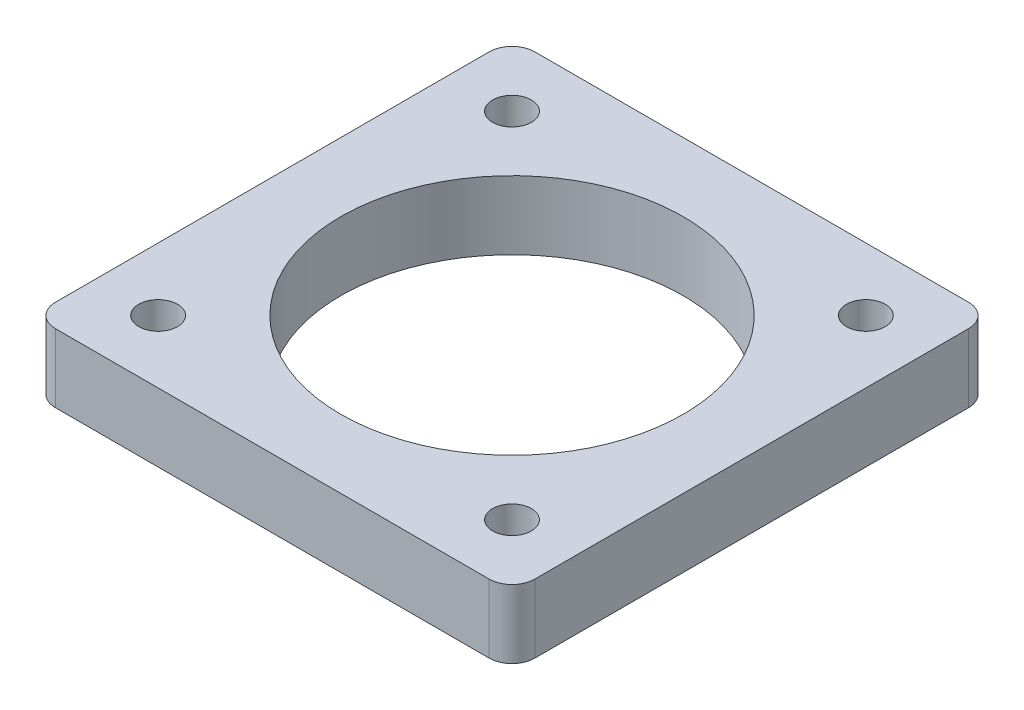
ISO-10303-21;
HEADER;
FILE_DESCRIPTION(('STEP AP214'),'2;1');
FILE_NAME('part.step','',(''),(''),'','','');
FILE_SCHEMA(('AUTOMOTIVE_DESIGN { 1 0 10303 214 1 1 1 1 }'));
ENDSEC;
DATA;
#1=APPLICATION_CONTEXT('core data for automotive mechanical design processes');
#2=APPLICATION_PROTOCOL_DEFINITION('international standard','automotive_design',2000,#1);
#3=PRODUCT_CONTEXT('',#1,'mechanical');
#4=PRODUCT('Part','Part','',(#3));
#5=PRODUCT_RELATED_PRODUCT_CATEGORY('part','',(#4));
#6=PRODUCT_DEFINITION_FORMATION('','',#4);
#7=PRODUCT_DEFINITION_CONTEXT('part definition',#1,'design');
#8=PRODUCT_DEFINITION('design','',#6,#7);
#9=PRODUCT_DEFINITION_SHAPE('','',#8);
#10=(LENGTH_UNIT() NAMED_UNIT(*) SI_UNIT(.MILLI.,.METRE.));
#11=(NAMED_UNIT(*) PLANE_ANGLE_UNIT() SI_UNIT($,.RADIAN.));
#12=(NAMED_UNIT(*) SI_UNIT($,.STERADIAN.) SOLID_ANGLE_UNIT());
#13=UNCERTAINTY_MEASURE_WITH_UNIT(LENGTH_MEASURE(1.E-05),#10,'distance_accuracy_value','');
#14=(GEOMETRIC_REPRESENTATION_CONTEXT(3) GLOBAL_UNCERTAINTY_ASSIGNED_CONTEXT((#13)) GLOBAL_UNIT_ASSIGNED_CONTEXT((#10,
#11,#12)) REPRESENTATION_CONTEXT('',''));
#15=CARTESIAN_POINT('',(0.,0.,0.));
#16=DIRECTION('',(0.,0.,1.));
#17=DIRECTION('',(1.,0.,0.));
#18=AXIS2_PLACEMENT_3D('',#15,#16,#17);
#19=CARTESIAN_POINT('',(0.,6.,0.));
#20=DIRECTION('',(0.,-1.,0.));
#21=DIRECTION('',(0.,0.,-1.));
#22=AXIS2_PLACEMENT_3D('',#19,#20,#21);
#23=PLANE('',#22);
#24=CARTESIAN_POINT('',(5.5,6.,-36.5));
#25=DIRECTION('',(0.,1.,0.));
#26=DIRECTION('',(0.,0.,1.));
#27=AXIS2_PLACEMENT_3D('',#24,#25,#26);
#28=CIRCLE('',#27,1.69999999999999);
#29=CARTESIAN_POINT('',(5.5,6.,-34.8));
#30=VERTEX_POINT('',#29);
#31=EDGE_CURVE('E204',#30,#30,#28,.T.);
#32=ORIENTED_EDGE('',*,*,#31,.F.);
#33=EDGE_LOOP('',(#32));
#34=FACE_BOUND('',#33,.T.);
#35=CARTESIAN_POINT('',(36.5,6.,-5.50000000000001));
#36=DIRECTION('',(0.,1.,0.));
#37=DIRECTION('',(0.,0.,1.));
#38=AXIS2_PLACEMENT_3D('',#35,#36,#37);
#39=CIRCLE('',#38,1.69999999999999);
#40=CARTESIAN_POINT('',(36.5,6.,-3.80000000000002));
#41=VERTEX_POINT('',#40);
#42=EDGE_CURVE('E198',#41,#41,#39,.T.);
#43=ORIENTED_EDGE('',*,*,#42,.F.);
#44=EDGE_LOOP('',(#43));
#45=FACE_BOUND('',#44,.T.);
#46=CARTESIAN_POINT('',(5.50000000000001,6.,-5.50000000000001));
#47=DIRECTION('',(0.,1.,0.));
#48=DIRECTION('',(0.,0.,1.));
#49=AXIS2_PLACEMENT_3D('',#46,#47,#48);
#50=CIRCLE('',#49,1.69999999999999);
#51=CARTESIAN_POINT('',(5.50000000000001,6.,-3.80000000000002));
#52=VERTEX_POINT('',#51);
#53=EDGE_CURVE('E192',#52,#52,#50,.T.);
#54=ORIENTED_EDGE('',*,*,#53,.F.);
#55=EDGE_LOOP('',(#54));
#56=FACE_BOUND('',#55,.T.);
#57=DIRECTION('',(0.,0.,-1.));
#58=VECTOR('',#57,1.);
#59=CARTESIAN_POINT('',(42.,6.,0.));
#60=LINE('',#59,#58);
#61=CARTESIAN_POINT('',(42.,6.,-2.));
#62=VERTEX_POINT('',#61);
#63=CARTESIAN_POINT('',(42.,6.,-40.));
#64=VERTEX_POINT('',#63);
#65=EDGE_CURVE('E174',#62,#64,#60,.T.);
#66=ORIENTED_EDGE('',*,*,#65,.T.);
#67=CARTESIAN_POINT('',(40.,6.,-40.));
#68=DIRECTION('',(0.,-1.,0.));
#69=DIRECTION('',(0.,0.,-1.));
#70=AXIS2_PLACEMENT_3D('',#67,#68,#69);
#71=CIRCLE('',#70,2.);
#72=CARTESIAN_POINT('',(40.,6.,-42.));
#73=VERTEX_POINT('',#72);
#74=EDGE_CURVE('E157',#64,#73,#71,.F.);
#75=ORIENTED_EDGE('',*,*,#74,.T.);
#76=DIRECTION('',(-1.,0.,0.));
#77=VECTOR('',#76,1.);
#78=CARTESIAN_POINT('',(0.,6.,-42.));
#79=LINE('',#78,#77);
#80=CARTESIAN_POINT('',(2.,6.,-42.));
#81=VERTEX_POINT('',#80);
#82=EDGE_CURVE('E128',#73,#81,#79,.T.);
#83=ORIENTED_EDGE('',*,*,#82,.T.);
#84=CARTESIAN_POINT('',(2.,6.,-40.));
#85=DIRECTION('',(0.,-1.,0.));
#86=DIRECTION('',(0.,0.,-1.));
#87=AXIS2_PLACEMENT_3D('',#84,#85,#86);
#88=CIRCLE('',#87,2.);
#89=CARTESIAN_POINT('',(0.,6.,-40.));
#90=VERTEX_POINT('',#89);
#91=EDGE_CURVE('E155',#81,#90,#88,.F.);
#92=ORIENTED_EDGE('',*,*,#91,.T.);
#93=DIRECTION('',(0.,0.,1.));
#94=VECTOR('',#93,1.);
#95=CARTESIAN_POINT('',(0.,6.,0.));
#96=LINE('',#95,#94);
#97=CARTESIAN_POINT('',(0.,6.,-2.));
#98=VERTEX_POINT('',#97);
#99=EDGE_CURVE('E135',#90,#98,#96,.T.);
#100=ORIENTED_EDGE('',*,*,#99,.T.);
#101=CARTESIAN_POINT('',(2.,6.,-2.));
#102=DIRECTION('',(0.,-1.,0.));
#103=DIRECTION('',(0.,0.,-1.));
#104=AXIS2_PLACEMENT_3D('',#101,#102,#103);
#105=CIRCLE('',#104,2.);
#106=CARTESIAN_POINT('',(2.,6.,0.));
#107=VERTEX_POINT('',#106);
#108=EDGE_CURVE('E63',#98,#107,#105,.F.);
#109=ORIENTED_EDGE('',*,*,#108,.T.);
#110=DIRECTION('',(1.,0.,0.));
#111=VECTOR('',#110,1.);
#112=CARTESIAN_POINT('',(0.,6.,0.));
#113=LINE('',#112,#111);
#114=CARTESIAN_POINT('',(40.,6.,0.));
#115=VERTEX_POINT('',#114);
#116=EDGE_CURVE('E138',#107,#115,#113,.T.);
#117=ORIENTED_EDGE('',*,*,#116,.T.);
#118=CARTESIAN_POINT('',(40.,6.,-2.));
#119=DIRECTION('',(0.,-1.,0.));
#120=DIRECTION('',(0.,0.,-1.));
#121=AXIS2_PLACEMENT_3D('',#118,#119,#120);
#122=CIRCLE('',#121,2.);
#123=EDGE_CURVE('E153',#115,#62,#122,.F.);
#124=ORIENTED_EDGE('',*,*,#123,.T.);
#125=EDGE_LOOP('',(#66,#75,#83,#92,#100,#109,#117,#124));
#126=FACE_BOUND('',#125,.T.);
#127=CARTESIAN_POINT('',(21.,6.,-21.));
#128=DIRECTION('',(0.,1.,0.));
#129=DIRECTION('',(0.,0.,1.));
#130=AXIS2_PLACEMENT_3D('',#127,#128,#129);
#131=CIRCLE('',#130,15.);
#132=CARTESIAN_POINT('',(21.,6.,-6.));
#133=VERTEX_POINT('',#132);
#134=EDGE_CURVE('E170',#133,#133,#131,.T.);
#135=ORIENTED_EDGE('',*,*,#134,.F.);
#136=EDGE_LOOP('',(#135));
#137=FACE_BOUND('',#136,.T.);
#138=CARTESIAN_POINT('',(36.5,6.,-36.5));
#139=DIRECTION('',(0.,1.,0.));
#140=DIRECTION('',(0.,0.,1.));
#141=AXIS2_PLACEMENT_3D('',#138,#139,#140);
#142=CIRCLE('',#141,1.69999999999999);
#143=CARTESIAN_POINT('',(36.5,6.,-34.8));
#144=VERTEX_POINT('',#143);
#145=EDGE_CURVE('E186',#144,#144,#142,.T.);
#146=ORIENTED_EDGE('',*,*,#145,.F.);
#147=EDGE_LOOP('',(#146));
#148=FACE_BOUND('',#147,.T.);
#149=ADVANCED_FACE('F43',(#34,#45,#56,#126,#137,#148),#23,.F.);
#150=CARTESIAN_POINT('',(0.,0.,0.));
#151=DIRECTION('',(0.,-1.,0.));
#152=DIRECTION('',(0.,0.,-1.));
#153=AXIS2_PLACEMENT_3D('',#150,#151,#152);
#154=PLANE('',#153);
#155=CARTESIAN_POINT('',(5.5,0.,-36.5));
#156=DIRECTION('',(0.,1.,0.));
#157=DIRECTION('',(0.,0.,1.));
#158=AXIS2_PLACEMENT_3D('',#155,#156,#157);
#159=CIRCLE('',#158,1.7);
#160=CARTESIAN_POINT('',(5.5,0.,-34.8));
#161=VERTEX_POINT('',#160);
#162=EDGE_CURVE('E201',#161,#161,#159,.T.);
#163=ORIENTED_EDGE('',*,*,#162,.T.);
#164=EDGE_LOOP('',(#163));
#165=FACE_BOUND('',#164,.T.);
#166=CARTESIAN_POINT('',(36.5,0.,-5.50000000000001));
#167=DIRECTION('',(0.,1.,0.));
#168=DIRECTION('',(0.,0.,1.));
#169=AXIS2_PLACEMENT_3D('',#166,#167,#168);
#170=CIRCLE('',#169,1.7);
#171=CARTESIAN_POINT('',(36.5,0.,-3.8));
#172=VERTEX_POINT('',#171);
#173=EDGE_CURVE('E195',#172,#172,#170,.T.);
#174=ORIENTED_EDGE('',*,*,#173,.T.);
#175=EDGE_LOOP('',(#174));
#176=FACE_BOUND('',#175,.T.);
#177=CARTESIAN_POINT('',(5.50000000000001,0.,-5.50000000000001));
#178=DIRECTION('',(0.,1.,0.));
#179=DIRECTION('',(0.,0.,1.));
#180=AXIS2_PLACEMENT_3D('',#177,#178,#179);
#181=CIRCLE('',#180,1.7);
#182=CARTESIAN_POINT('',(5.50000000000001,0.,-3.80000000000001));
#183=VERTEX_POINT('',#182);
#184=EDGE_CURVE('E189',#183,#183,#181,.T.);
#185=ORIENTED_EDGE('',*,*,#184,.T.);
#186=EDGE_LOOP('',(#185));
#187=FACE_BOUND('',#186,.T.);
#188=CARTESIAN_POINT('',(36.5,0.,-36.5));
#189=DIRECTION('',(0.,1.,0.));
#190=DIRECTION('',(0.,0.,1.));
#191=AXIS2_PLACEMENT_3D('',#188,#189,#190);
#192=CIRCLE('',#191,1.7);
#193=CARTESIAN_POINT('',(36.5,0.,-34.8));
#194=VERTEX_POINT('',#193);
#195=EDGE_CURVE('E181',#194,#194,#192,.T.);
#196=ORIENTED_EDGE('',*,*,#195,.T.);
#197=EDGE_LOOP('',(#196));
#198=FACE_BOUND('',#197,.T.);
#199=DIRECTION('',(-1.,0.,0.));
#200=VECTOR('',#199,1.);
#201=CARTESIAN_POINT('',(0.,0.,-42.));
#202=LINE('',#201,#200);
#203=CARTESIAN_POINT('',(40.,0.,-42.));
#204=VERTEX_POINT('',#203);
#205=CARTESIAN_POINT('',(2.,0.,-42.));
#206=VERTEX_POINT('',#205);
#207=EDGE_CURVE('E125',#204,#206,#202,.T.);
#208=ORIENTED_EDGE('',*,*,#207,.F.);
#209=CARTESIAN_POINT('',(40.,0.,-40.));
#210=DIRECTION('',(0.,-1.,0.));
#211=DIRECTION('',(0.,0.,-1.));
#212=AXIS2_PLACEMENT_3D('',#209,#210,#211);
#213=CIRCLE('',#212,2.);
#214=CARTESIAN_POINT('',(42.,0.,-40.));
#215=VERTEX_POINT('',#214);
#216=EDGE_CURVE('E108',#204,#215,#213,.T.);
#217=ORIENTED_EDGE('',*,*,#216,.T.);
#218=DIRECTION('',(0.,0.,-1.));
#219=VECTOR('',#218,1.);
#220=CARTESIAN_POINT('',(42.,0.,0.));
#221=LINE('',#220,#219);
#222=CARTESIAN_POINT('',(42.,0.,-2.));
#223=VERTEX_POINT('',#222);
#224=EDGE_CURVE('E136',#223,#215,#221,.T.);
#225=ORIENTED_EDGE('',*,*,#224,.F.);
#226=CARTESIAN_POINT('',(40.,0.,-2.));
#227=DIRECTION('',(0.,-1.,0.));
#228=DIRECTION('',(0.,0.,-1.));
#229=AXIS2_PLACEMENT_3D('',#226,#227,#228);
#230=CIRCLE('',#229,2.);
#231=CARTESIAN_POINT('',(40.,0.,0.));
#232=VERTEX_POINT('',#231);
#233=EDGE_CURVE('E146',#223,#232,#230,.T.);
#234=ORIENTED_EDGE('',*,*,#233,.T.);
#235=DIRECTION('',(1.,0.,0.));
#236=VECTOR('',#235,1.);
#237=CARTESIAN_POINT('',(0.,0.,0.));
#238=LINE('',#237,#236);
#239=CARTESIAN_POINT('',(2.,0.,0.));
#240=VERTEX_POINT('',#239);
#241=EDGE_CURVE('E140',#240,#232,#238,.T.);
#242=ORIENTED_EDGE('',*,*,#241,.F.);
#243=CARTESIAN_POINT('',(2.,0.,-2.));
#244=DIRECTION('',(0.,-1.,0.));
#245=DIRECTION('',(0.,0.,-1.));
#246=AXIS2_PLACEMENT_3D('',#243,#244,#245);
#247=CIRCLE('',#246,2.);
#248=CARTESIAN_POINT('',(0.,0.,-2.));
#249=VERTEX_POINT('',#248);
#250=EDGE_CURVE('E129',#240,#249,#247,.T.);
#251=ORIENTED_EDGE('',*,*,#250,.T.);
#252=DIRECTION('',(0.,0.,1.));
#253=VECTOR('',#252,1.);
#254=CARTESIAN_POINT('',(0.,0.,0.));
#255=LINE('',#254,#253);
#256=CARTESIAN_POINT('',(0.,0.,-40.));
#257=VERTEX_POINT('',#256);
#258=EDGE_CURVE('E169',#257,#249,#255,.T.);
#259=ORIENTED_EDGE('',*,*,#258,.F.);
#260=CARTESIAN_POINT('',(2.,0.,-40.));
#261=DIRECTION('',(0.,-1.,0.));
#262=DIRECTION('',(0.,0.,-1.));
#263=AXIS2_PLACEMENT_3D('',#260,#261,#262);
#264=CIRCLE('',#263,2.);
#265=EDGE_CURVE('E119',#257,#206,#264,.T.);
#266=ORIENTED_EDGE('',*,*,#265,.T.);
#267=EDGE_LOOP('',(#208,#217,#225,#234,#242,#251,#259,#266));
#268=FACE_BOUND('',#267,.T.);
#269=CARTESIAN_POINT('',(21.,0.,-21.));
#270=DIRECTION('',(0.,1.,0.));
#271=DIRECTION('',(0.,0.,1.));
#272=AXIS2_PLACEMENT_3D('',#269,#270,#271);
#273=CIRCLE('',#272,15.);
#274=CARTESIAN_POINT('',(21.,0.,-6.));
#275=VERTEX_POINT('',#274);
#276=EDGE_CURVE('E178',#275,#275,#273,.T.);
#277=ORIENTED_EDGE('',*,*,#276,.T.);
#278=EDGE_LOOP('',(#277));
#279=FACE_BOUND('',#278,.T.);
#280=ADVANCED_FACE('F132',(#165,#176,#187,#198,#268,#279),#154,.T.);
#281=CARTESIAN_POINT('',(0.,6.,0.));
#282=DIRECTION('',(1.,0.,0.));
#283=DIRECTION('',(0.,0.,-1.));
#284=AXIS2_PLACEMENT_3D('',#281,#282,#283);
#285=PLANE('',#284);
#286=ORIENTED_EDGE('',*,*,#99,.F.);
#287=DIRECTION('',(0.,-1.,0.));
#288=VECTOR('',#287,1.);
#289=CARTESIAN_POINT('',(0.,6.,-40.));
#290=LINE('',#289,#288);
#291=EDGE_CURVE('E161',#90,#257,#290,.T.);
#292=ORIENTED_EDGE('',*,*,#291,.T.);
#293=ORIENTED_EDGE('',*,*,#258,.T.);
#294=DIRECTION('',(0.,-1.,0.));
#295=VECTOR('',#294,1.);
#296=CARTESIAN_POINT('',(0.,6.,-2.));
#297=LINE('',#296,#295);
#298=EDGE_CURVE('E159',#249,#98,#297,.F.);
#299=ORIENTED_EDGE('',*,*,#298,.T.);
#300=EDGE_LOOP('',(#286,#292,#293,#299));
#301=FACE_BOUND('',#300,.T.);
#302=ADVANCED_FACE('F244',(#301),#285,.F.);
#303=CARTESIAN_POINT('',(0.,6.,0.));
#304=DIRECTION('',(0.,0.,-1.));
#305=DIRECTION('',(-1.,0.,0.));
#306=AXIS2_PLACEMENT_3D('',#303,#304,#305);
#307=PLANE('',#306);
#308=ORIENTED_EDGE('',*,*,#241,.T.);
#309=DIRECTION('',(0.,-1.,0.));
#310=VECTOR('',#309,1.);
#311=CARTESIAN_POINT('',(40.,6.,0.));
#312=LINE('',#311,#310);
#313=EDGE_CURVE('E11',#232,#115,#312,.F.);
#314=ORIENTED_EDGE('',*,*,#313,.T.);
#315=ORIENTED_EDGE('',*,*,#116,.F.);
#316=DIRECTION('',(0.,-1.,0.));
#317=VECTOR('',#316,1.);
#318=CARTESIAN_POINT('',(2.,6.,0.));
#319=LINE('',#318,#317);
#320=EDGE_CURVE('E51',#107,#240,#319,.T.);
#321=ORIENTED_EDGE('',*,*,#320,.T.);
#322=EDGE_LOOP('',(#308,#314,#315,#321));
#323=FACE_BOUND('',#322,.T.);
#324=ADVANCED_FACE('F166',(#323),#307,.F.);
#325=CARTESIAN_POINT('',(42.,6.,0.));
#326=DIRECTION('',(-1.,0.,0.));
#327=DIRECTION('',(0.,0.,1.));
#328=AXIS2_PLACEMENT_3D('',#325,#326,#327);
#329=PLANE('',#328);
#330=ORIENTED_EDGE('',*,*,#224,.T.);
#331=DIRECTION('',(0.,-1.,0.));
#332=VECTOR('',#331,1.);
#333=CARTESIAN_POINT('',(42.,6.,-40.));
#334=LINE('',#333,#332);
#335=EDGE_CURVE('E113',#215,#64,#334,.F.);
#336=ORIENTED_EDGE('',*,*,#335,.T.);
#337=ORIENTED_EDGE('',*,*,#65,.F.);
#338=DIRECTION('',(0.,-1.,0.));
#339=VECTOR('',#338,1.);
#340=CARTESIAN_POINT('',(42.,6.,-2.));
#341=LINE('',#340,#339);
#342=EDGE_CURVE('E118',#62,#223,#341,.T.);
#343=ORIENTED_EDGE('',*,*,#342,.T.);
#344=EDGE_LOOP('',(#330,#336,#337,#343));
#345=FACE_BOUND('',#344,.T.);
#346=ADVANCED_FACE('F248',(#345),#329,.F.);
#347=CARTESIAN_POINT('',(0.,6.,-42.));
#348=DIRECTION('',(0.,0.,1.));
#349=DIRECTION('',(1.,0.,0.));
#350=AXIS2_PLACEMENT_3D('',#347,#348,#349);
#351=PLANE('',#350);
#352=ORIENTED_EDGE('',*,*,#82,.F.);
#353=DIRECTION('',(0.,-1.,0.));
#354=VECTOR('',#353,1.);
#355=CARTESIAN_POINT('',(40.,6.,-42.));
#356=LINE('',#355,#354);
#357=EDGE_CURVE('E112',#73,#204,#356,.T.);
#358=ORIENTED_EDGE('',*,*,#357,.T.);
#359=ORIENTED_EDGE('',*,*,#207,.T.);
#360=DIRECTION('',(0.,-1.,0.));
#361=VECTOR('',#360,1.);
#362=CARTESIAN_POINT('',(2.,6.,-42.));
#363=LINE('',#362,#361);
#364=EDGE_CURVE('E130',#206,#81,#363,.F.);
#365=ORIENTED_EDGE('',*,*,#364,.T.);
#366=EDGE_LOOP('',(#352,#358,#359,#365));
#367=FACE_BOUND('',#366,.T.);
#368=ADVANCED_FACE('F124',(#367),#351,.F.);
#369=CARTESIAN_POINT('',(21.,6.,-21.));
#370=DIRECTION('',(0.,-1.,0.));
#371=DIRECTION('',(0.,0.,-1.));
#372=AXIS2_PLACEMENT_3D('',#369,#370,#371);
#373=CYLINDRICAL_SURFACE('',#372,15.);
#374=ORIENTED_EDGE('',*,*,#134,.T.);
#375=EDGE_LOOP('',(#374));
#376=FACE_BOUND('',#375,.T.);
#377=ORIENTED_EDGE('',*,*,#276,.F.);
#378=EDGE_LOOP('',(#377));
#379=FACE_BOUND('',#378,.T.);
#380=ADVANCED_FACE('F239',(#376,#379),#373,.F.);
#381=CARTESIAN_POINT('',(40.,6.,-40.));
#382=DIRECTION('',(0.,-1.,0.));
#383=DIRECTION('',(0.,0.,-1.));
#384=AXIS2_PLACEMENT_3D('',#381,#382,#383);
#385=CYLINDRICAL_SURFACE('',#384,2.);
#386=ORIENTED_EDGE('',*,*,#74,.F.);
#387=ORIENTED_EDGE('',*,*,#335,.F.);
#388=ORIENTED_EDGE('',*,*,#216,.F.);
#389=ORIENTED_EDGE('',*,*,#357,.F.);
#390=EDGE_LOOP('',(#386,#387,#388,#389));
#391=FACE_BOUND('',#390,.T.);
#392=ADVANCED_FACE('F111',(#391),#385,.T.);
#393=CARTESIAN_POINT('',(2.,6.,-40.));
#394=DIRECTION('',(0.,-1.,0.));
#395=DIRECTION('',(0.,0.,-1.));
#396=AXIS2_PLACEMENT_3D('',#393,#394,#395);
#397=CYLINDRICAL_SURFACE('',#396,2.);
#398=ORIENTED_EDGE('',*,*,#91,.F.);
#399=ORIENTED_EDGE('',*,*,#364,.F.);
#400=ORIENTED_EDGE('',*,*,#265,.F.);
#401=ORIENTED_EDGE('',*,*,#291,.F.);
#402=EDGE_LOOP('',(#398,#399,#400,#401));
#403=FACE_BOUND('',#402,.T.);
#404=ADVANCED_FACE('F259',(#403),#397,.T.);
#405=CARTESIAN_POINT('',(40.,6.,-2.));
#406=DIRECTION('',(0.,-1.,0.));
#407=DIRECTION('',(0.,0.,-1.));
#408=AXIS2_PLACEMENT_3D('',#405,#406,#407);
#409=CYLINDRICAL_SURFACE('',#408,2.);
#410=ORIENTED_EDGE('',*,*,#123,.F.);
#411=ORIENTED_EDGE('',*,*,#313,.F.);
#412=ORIENTED_EDGE('',*,*,#233,.F.);
#413=ORIENTED_EDGE('',*,*,#342,.F.);
#414=EDGE_LOOP('',(#410,#411,#412,#413));
#415=FACE_BOUND('',#414,.T.);
#416=ADVANCED_FACE('F235',(#415),#409,.T.);
#417=CARTESIAN_POINT('',(2.,6.,-2.));
#418=DIRECTION('',(0.,-1.,0.));
#419=DIRECTION('',(0.,0.,-1.));
#420=AXIS2_PLACEMENT_3D('',#417,#418,#419);
#421=CYLINDRICAL_SURFACE('',#420,2.);
#422=ORIENTED_EDGE('',*,*,#108,.F.);
#423=ORIENTED_EDGE('',*,*,#298,.F.);
#424=ORIENTED_EDGE('',*,*,#250,.F.);
#425=ORIENTED_EDGE('',*,*,#320,.F.);
#426=EDGE_LOOP('',(#422,#423,#424,#425));
#427=FACE_BOUND('',#426,.T.);
#428=ADVANCED_FACE('F45',(#427),#421,.T.);
#429=CARTESIAN_POINT('',(36.5,6.,-36.5));
#430=DIRECTION('',(0.,1.,0.));
#431=DIRECTION('',(0.,0.,1.));
#432=AXIS2_PLACEMENT_3D('',#429,#430,#431);
#433=CYLINDRICAL_SURFACE('',#432,1.69999999999999);
#434=ORIENTED_EDGE('',*,*,#195,.F.);
#435=EDGE_LOOP('',(#434));
#436=FACE_BOUND('',#435,.T.);
#437=ORIENTED_EDGE('',*,*,#145,.T.);
#438=EDGE_LOOP('',(#437));
#439=FACE_BOUND('',#438,.T.);
#440=ADVANCED_FACE('F222',(#436,#439),#433,.F.);
#441=CARTESIAN_POINT('',(5.50000000000001,6.,-5.50000000000001));
#442=DIRECTION('',(0.,1.,0.));
#443=DIRECTION('',(0.,0.,1.));
#444=AXIS2_PLACEMENT_3D('',#441,#442,#443);
#445=CYLINDRICAL_SURFACE('',#444,1.69999999999999);
#446=ORIENTED_EDGE('',*,*,#184,.F.);
#447=EDGE_LOOP('',(#446));
#448=FACE_BOUND('',#447,.T.);
#449=ORIENTED_EDGE('',*,*,#53,.T.);
#450=EDGE_LOOP('',(#449));
#451=FACE_BOUND('',#450,.T.);
#452=ADVANCED_FACE('F224',(#448,#451),#445,.F.);
#453=CARTESIAN_POINT('',(36.5,6.,-5.50000000000001));
#454=DIRECTION('',(0.,1.,0.));
#455=DIRECTION('',(0.,0.,1.));
#456=AXIS2_PLACEMENT_3D('',#453,#454,#455);
#457=CYLINDRICAL_SURFACE('',#456,1.69999999999999);
#458=ORIENTED_EDGE('',*,*,#173,.F.);
#459=EDGE_LOOP('',(#458));
#460=FACE_BOUND('',#459,.T.);
#461=ORIENTED_EDGE('',*,*,#42,.T.);
#462=EDGE_LOOP('',(#461));
#463=FACE_BOUND('',#462,.T.);
#464=ADVANCED_FACE('F231',(#460,#463),#457,.F.);
#465=CARTESIAN_POINT('',(5.5,6.,-36.5));
#466=DIRECTION('',(0.,1.,0.));
#467=DIRECTION('',(0.,0.,1.));
#468=AXIS2_PLACEMENT_3D('',#465,#466,#467);
#469=CYLINDRICAL_SURFACE('',#468,1.69999999999999);
#470=ORIENTED_EDGE('',*,*,#162,.F.);
#471=EDGE_LOOP('',(#470));
#472=FACE_BOUND('',#471,.T.);
#473=ORIENTED_EDGE('',*,*,#31,.T.);
#474=EDGE_LOOP('',(#473));
#475=FACE_BOUND('',#474,.T.);
#476=ADVANCED_FACE('F208',(#472,#475),#469,.F.);
#477=CLOSED_SHELL('',(#149,#280,#302,#324,#346,#368,#380,#392,#404,#416,#428,#440,#452,#464,#476));
#478=MANIFOLD_SOLID_BREP('B2',#477);
#479=ADVANCED_BREP_SHAPE_REPRESENTATION('',(#18,#478),#14);
#480=SHAPE_DEFINITION_REPRESENTATION(#9,#479);
ENDSEC;
END-ISO-10303-21;
